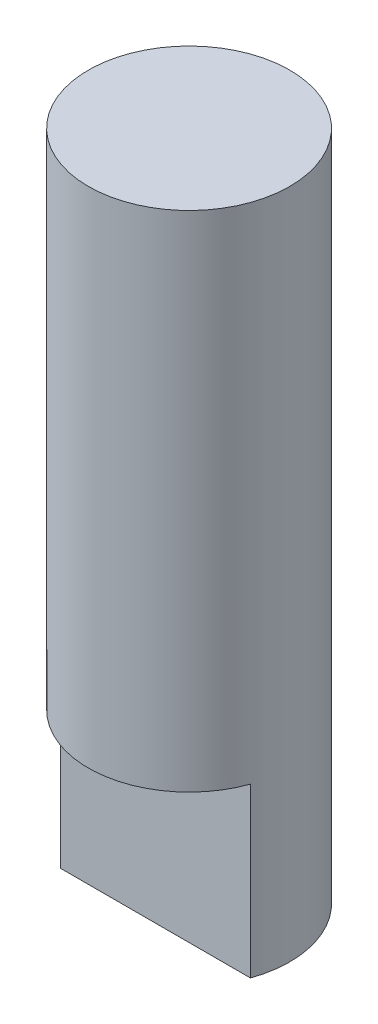
ISO-10303-21;
HEADER;
FILE_DESCRIPTION(('STEP AP214'),'2;1');
FILE_NAME('part.step','',(''),(''),'','','');
FILE_SCHEMA(('AUTOMOTIVE_DESIGN { 1 0 10303 214 1 1 1 1 }'));
ENDSEC;
DATA;
#1=APPLICATION_CONTEXT('core data for automotive mechanical design processes');
#2=APPLICATION_PROTOCOL_DEFINITION('international standard','automotive_design',2000,#1);
#3=PRODUCT_CONTEXT('',#1,'mechanical');
#4=PRODUCT('Part','Part','',(#3));
#5=PRODUCT_RELATED_PRODUCT_CATEGORY('part','',(#4));
#6=PRODUCT_DEFINITION_FORMATION('','',#4);
#7=PRODUCT_DEFINITION_CONTEXT('part definition',#1,'design');
#8=PRODUCT_DEFINITION('design','',#6,#7);
#9=PRODUCT_DEFINITION_SHAPE('','',#8);
#10=(LENGTH_UNIT() NAMED_UNIT(*) SI_UNIT(.MILLI.,.METRE.));
#11=(NAMED_UNIT(*) PLANE_ANGLE_UNIT() SI_UNIT($,.RADIAN.));
#12=(NAMED_UNIT(*) SI_UNIT($,.STERADIAN.) SOLID_ANGLE_UNIT());
#13=UNCERTAINTY_MEASURE_WITH_UNIT(LENGTH_MEASURE(1.E-05),#10,'distance_accuracy_value','');
#14=(GEOMETRIC_REPRESENTATION_CONTEXT(3) GLOBAL_UNCERTAINTY_ASSIGNED_CONTEXT((#13)) GLOBAL_UNIT_ASSIGNED_CONTEXT((#10,
#11,#12)) REPRESENTATION_CONTEXT('',''));
#15=CARTESIAN_POINT('',(0.,0.,0.));
#16=DIRECTION('',(0.,0.,1.));
#17=DIRECTION('',(1.,0.,0.));
#18=AXIS2_PLACEMENT_3D('',#15,#16,#17);
#19=CARTESIAN_POINT('',(0.,20.,0.));
#20=DIRECTION('',(0.,-1.,0.));
#21=DIRECTION('',(0.,0.,-1.));
#22=AXIS2_PLACEMENT_3D('',#19,#20,#21);
#23=CYLINDRICAL_SURFACE('',#22,3.);
#24=CARTESIAN_POINT('',(0.,20.,0.));
#25=DIRECTION('',(0.,1.,0.));
#26=DIRECTION('',(0.,0.,1.));
#27=AXIS2_PLACEMENT_3D('',#24,#25,#26);
#28=CIRCLE('',#27,3.);
#29=CARTESIAN_POINT('',(0.,20.,3.));
#30=VERTEX_POINT('',#29);
#31=EDGE_CURVE('E11',#30,#30,#28,.T.);
#32=ORIENTED_EDGE('',*,*,#31,.F.);
#33=EDGE_LOOP('',(#32));
#34=FACE_BOUND('',#33,.T.);
#35=CARTESIAN_POINT('',(0.,5.,0.));
#36=DIRECTION('',(0.,1.,0.));
#37=DIRECTION('',(0.,0.,1.));
#38=AXIS2_PLACEMENT_3D('',#35,#36,#37);
#39=CIRCLE('',#38,3.);
#40=CARTESIAN_POINT('',(-2.82842712474619,5.,1.));
#41=VERTEX_POINT('',#40);
#42=CARTESIAN_POINT('',(2.82842712474619,5.,1.));
#43=VERTEX_POINT('',#42);
#44=EDGE_CURVE('E55',#41,#43,#39,.T.);
#45=ORIENTED_EDGE('',*,*,#44,.T.);
#46=DIRECTION('',(0.,-1.,0.));
#47=VECTOR('',#46,1.);
#48=CARTESIAN_POINT('',(2.82842712474619,5.,1.));
#49=LINE('',#48,#47);
#50=CARTESIAN_POINT('',(2.82842712474619,0.,1.));
#51=VERTEX_POINT('',#50);
#52=EDGE_CURVE('E62',#43,#51,#49,.T.);
#53=ORIENTED_EDGE('',*,*,#52,.T.);
#54=CARTESIAN_POINT('',(0.,0.,0.));
#55=DIRECTION('',(0.,1.,0.));
#56=DIRECTION('',(0.,0.,1.));
#57=AXIS2_PLACEMENT_3D('',#54,#55,#56);
#58=CIRCLE('',#57,3.);
#59=CARTESIAN_POINT('',(-2.82842712474619,0.,1.));
#60=VERTEX_POINT('',#59);
#61=EDGE_CURVE('E36',#51,#60,#58,.T.);
#62=ORIENTED_EDGE('',*,*,#61,.T.);
#63=DIRECTION('',(0.,-1.,0.));
#64=VECTOR('',#63,1.);
#65=CARTESIAN_POINT('',(-2.82842712474619,5.,1.));
#66=LINE('',#65,#64);
#67=EDGE_CURVE('E47',#41,#60,#66,.T.);
#68=ORIENTED_EDGE('',*,*,#67,.F.);
#69=EDGE_LOOP('',(#45,#53,#62,#68));
#70=FACE_BOUND('',#69,.T.);
#71=ADVANCED_FACE('F33',(#34,#70),#23,.T.);
#72=CARTESIAN_POINT('',(0.,20.,0.));
#73=DIRECTION('',(0.,1.,0.));
#74=DIRECTION('',(0.,0.,1.));
#75=AXIS2_PLACEMENT_3D('',#72,#73,#74);
#76=PLANE('',#75);
#77=ORIENTED_EDGE('',*,*,#31,.T.);
#78=EDGE_LOOP('',(#77));
#79=FACE_BOUND('',#78,.T.);
#80=ADVANCED_FACE('F82',(#79),#76,.T.);
#81=CARTESIAN_POINT('',(0.,0.,0.));
#82=DIRECTION('',(0.,1.,0.));
#83=DIRECTION('',(0.,0.,1.));
#84=AXIS2_PLACEMENT_3D('',#81,#82,#83);
#85=PLANE('',#84);
#86=ORIENTED_EDGE('',*,*,#61,.F.);
#87=DIRECTION('',(1.,0.,0.));
#88=VECTOR('',#87,1.);
#89=CARTESIAN_POINT('',(-2.82842712474619,0.,1.));
#90=LINE('',#89,#88);
#91=EDGE_CURVE('E59',#60,#51,#90,.T.);
#92=ORIENTED_EDGE('',*,*,#91,.F.);
#93=EDGE_LOOP('',(#86,#92));
#94=FACE_BOUND('',#93,.T.);
#95=ADVANCED_FACE('F70',(#94),#85,.F.);
#96=CARTESIAN_POINT('',(-2.82842712474619,5.,1.));
#97=DIRECTION('',(0.,0.,-1.));
#98=DIRECTION('',(-1.,0.,0.));
#99=AXIS2_PLACEMENT_3D('',#96,#97,#98);
#100=PLANE('',#99);
#101=ORIENTED_EDGE('',*,*,#91,.T.);
#102=ORIENTED_EDGE('',*,*,#52,.F.);
#103=DIRECTION('',(1.,0.,0.));
#104=VECTOR('',#103,1.);
#105=CARTESIAN_POINT('',(-2.82842712474619,5.,1.));
#106=LINE('',#105,#104);
#107=EDGE_CURVE('E66',#41,#43,#106,.T.);
#108=ORIENTED_EDGE('',*,*,#107,.F.);
#109=ORIENTED_EDGE('',*,*,#67,.T.);
#110=EDGE_LOOP('',(#101,#102,#108,#109));
#111=FACE_BOUND('',#110,.T.);
#112=ADVANCED_FACE('F61',(#111),#100,.F.);
#113=CARTESIAN_POINT('',(0.,5.,0.));
#114=DIRECTION('',(0.,1.,0.));
#115=DIRECTION('',(0.,0.,1.));
#116=AXIS2_PLACEMENT_3D('',#113,#114,#115);
#117=PLANE('',#116);
#118=ORIENTED_EDGE('',*,*,#107,.T.);
#119=ORIENTED_EDGE('',*,*,#44,.F.);
#120=EDGE_LOOP('',(#118,#119));
#121=FACE_BOUND('',#120,.T.);
#122=ADVANCED_FACE('F74',(#121),#117,.F.);
#123=CLOSED_SHELL('',(#71,#80,#95,#112,#122));
#124=MANIFOLD_SOLID_BREP('B2',#123);
#125=ADVANCED_BREP_SHAPE_REPRESENTATION('',(#18,#124),#14);
#126=SHAPE_DEFINITION_REPRESENTATION(#9,#125);
ENDSEC;
END-ISO-10303-21;
